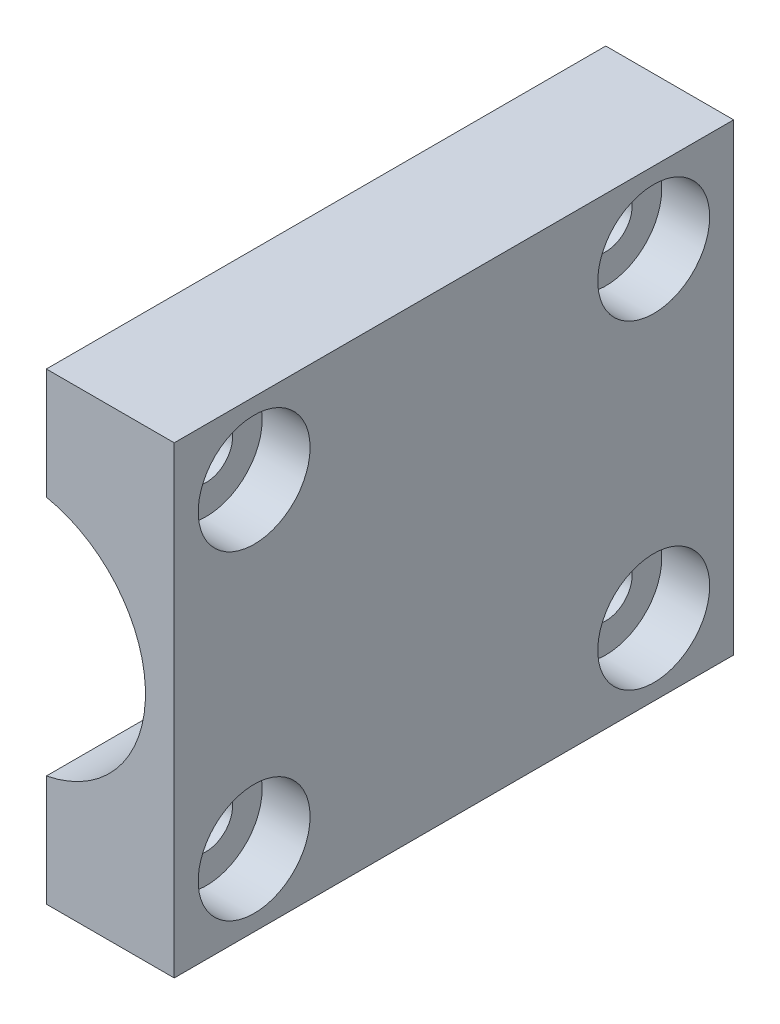
ISO-10303-21;
HEADER;
FILE_DESCRIPTION(('STEP AP214'),'2;1');
FILE_NAME('part.step','',(''),(''),'','','');
FILE_SCHEMA(('AUTOMOTIVE_DESIGN { 1 0 10303 214 1 1 1 1 }'));
ENDSEC;
DATA;
#1=APPLICATION_CONTEXT('core data for automotive mechanical design processes');
#2=APPLICATION_PROTOCOL_DEFINITION('international standard','automotive_design',2000,#1);
#3=PRODUCT_CONTEXT('',#1,'mechanical');
#4=PRODUCT('Part','Part','',(#3));
#5=PRODUCT_RELATED_PRODUCT_CATEGORY('part','',(#4));
#6=PRODUCT_DEFINITION_FORMATION('','',#4);
#7=PRODUCT_DEFINITION_CONTEXT('part definition',#1,'design');
#8=PRODUCT_DEFINITION('design','',#6,#7);
#9=PRODUCT_DEFINITION_SHAPE('','',#8);
#10=(LENGTH_UNIT() NAMED_UNIT(*) SI_UNIT(.MILLI.,.METRE.));
#11=(NAMED_UNIT(*) PLANE_ANGLE_UNIT() SI_UNIT($,.RADIAN.));
#12=(NAMED_UNIT(*) SI_UNIT($,.STERADIAN.) SOLID_ANGLE_UNIT());
#13=UNCERTAINTY_MEASURE_WITH_UNIT(LENGTH_MEASURE(1.E-05),#10,'distance_accuracy_value','');
#14=(GEOMETRIC_REPRESENTATION_CONTEXT(3) GLOBAL_UNCERTAINTY_ASSIGNED_CONTEXT((#13)) GLOBAL_UNIT_ASSIGNED_CONTEXT((#10,
#11,#12)) REPRESENTATION_CONTEXT('',''));
#15=CARTESIAN_POINT('',(0.,0.,0.));
#16=DIRECTION('',(0.,0.,1.));
#17=DIRECTION('',(1.,0.,0.));
#18=AXIS2_PLACEMENT_3D('',#15,#16,#17);
#19=CARTESIAN_POINT('',(9.5,10.,5.));
#20=DIRECTION('',(-1.,0.,0.));
#21=DIRECTION('',(0.,0.,1.));
#22=AXIS2_PLACEMENT_3D('',#19,#20,#21);
#23=CYLINDRICAL_SURFACE('',#22,1.65);
#24=CARTESIAN_POINT('',(1.5,10.,5.));
#25=DIRECTION('',(1.,0.,0.));
#26=DIRECTION('',(0.,0.,-1.));
#27=AXIS2_PLACEMENT_3D('',#24,#25,#26);
#28=CIRCLE('',#27,1.65);
#29=CARTESIAN_POINT('',(1.5,10.,3.35));
#30=VERTEX_POINT('',#29);
#31=EDGE_CURVE('E124',#30,#30,#28,.F.);
#32=ORIENTED_EDGE('',*,*,#31,.T.);
#33=EDGE_LOOP('',(#32));
#34=FACE_BOUND('',#33,.T.);
#35=CARTESIAN_POINT('',(6.5,10.,5.));
#36=DIRECTION('',(1.,0.,0.));
#37=DIRECTION('',(0.,0.,-1.));
#38=AXIS2_PLACEMENT_3D('',#35,#36,#37);
#39=CIRCLE('',#38,1.65);
#40=CARTESIAN_POINT('',(6.5,10.,3.35));
#41=VERTEX_POINT('',#40);
#42=EDGE_CURVE('E36',#41,#41,#39,.F.);
#43=ORIENTED_EDGE('',*,*,#42,.F.);
#44=EDGE_LOOP('',(#43));
#45=FACE_BOUND('',#44,.T.);
#46=ADVANCED_FACE('F32',(#34,#45),#23,.F.);
#47=CARTESIAN_POINT('',(9.5,-10.,30.));
#48=DIRECTION('',(-1.,0.,0.));
#49=DIRECTION('',(0.,0.,1.));
#50=AXIS2_PLACEMENT_3D('',#47,#48,#49);
#51=CYLINDRICAL_SURFACE('',#50,1.65);
#52=CARTESIAN_POINT('',(1.5,-10.,30.));
#53=DIRECTION('',(1.,0.,0.));
#54=DIRECTION('',(0.,0.,-1.));
#55=AXIS2_PLACEMENT_3D('',#52,#53,#54);
#56=CIRCLE('',#55,1.65);
#57=CARTESIAN_POINT('',(1.5,-10.,28.35));
#58=VERTEX_POINT('',#57);
#59=EDGE_CURVE('E121',#58,#58,#56,.F.);
#60=ORIENTED_EDGE('',*,*,#59,.T.);
#61=EDGE_LOOP('',(#60));
#62=FACE_BOUND('',#61,.T.);
#63=CARTESIAN_POINT('',(6.5,-10.,30.));
#64=DIRECTION('',(1.,0.,0.));
#65=DIRECTION('',(0.,0.,-1.));
#66=AXIS2_PLACEMENT_3D('',#63,#64,#65);
#67=CIRCLE('',#66,1.65);
#68=CARTESIAN_POINT('',(6.5,-10.,28.35));
#69=VERTEX_POINT('',#68);
#70=EDGE_CURVE('E148',#69,#69,#67,.F.);
#71=ORIENTED_EDGE('',*,*,#70,.F.);
#72=EDGE_LOOP('',(#71));
#73=FACE_BOUND('',#72,.T.);
#74=ADVANCED_FACE('F192',(#62,#73),#51,.F.);
#75=CARTESIAN_POINT('',(9.5,-10.,5.));
#76=DIRECTION('',(-1.,0.,0.));
#77=DIRECTION('',(0.,0.,1.));
#78=AXIS2_PLACEMENT_3D('',#75,#76,#77);
#79=CYLINDRICAL_SURFACE('',#78,1.65);
#80=CARTESIAN_POINT('',(1.5,-10.,5.));
#81=DIRECTION('',(1.,0.,0.));
#82=DIRECTION('',(0.,0.,-1.));
#83=AXIS2_PLACEMENT_3D('',#80,#81,#82);
#84=CIRCLE('',#83,1.65);
#85=CARTESIAN_POINT('',(1.5,-10.,3.35));
#86=VERTEX_POINT('',#85);
#87=EDGE_CURVE('E118',#86,#86,#84,.F.);
#88=ORIENTED_EDGE('',*,*,#87,.T.);
#89=EDGE_LOOP('',(#88));
#90=FACE_BOUND('',#89,.T.);
#91=CARTESIAN_POINT('',(6.5,-10.,5.));
#92=DIRECTION('',(1.,0.,0.));
#93=DIRECTION('',(0.,0.,-1.));
#94=AXIS2_PLACEMENT_3D('',#91,#92,#93);
#95=CIRCLE('',#94,1.65);
#96=CARTESIAN_POINT('',(6.5,-10.,3.35));
#97=VERTEX_POINT('',#96);
#98=EDGE_CURVE('E146',#97,#97,#95,.F.);
#99=ORIENTED_EDGE('',*,*,#98,.F.);
#100=EDGE_LOOP('',(#99));
#101=FACE_BOUND('',#100,.T.);
#102=ADVANCED_FACE('F198',(#90,#101),#79,.F.);
#103=CARTESIAN_POINT('',(9.5,10.,30.));
#104=DIRECTION('',(-1.,0.,0.));
#105=DIRECTION('',(0.,0.,1.));
#106=AXIS2_PLACEMENT_3D('',#103,#104,#105);
#107=CYLINDRICAL_SURFACE('',#106,1.65);
#108=CARTESIAN_POINT('',(1.5,10.,30.));
#109=DIRECTION('',(1.,0.,0.));
#110=DIRECTION('',(0.,0.,-1.));
#111=AXIS2_PLACEMENT_3D('',#108,#109,#110);
#112=CIRCLE('',#111,1.65);
#113=CARTESIAN_POINT('',(1.5,10.,28.35));
#114=VERTEX_POINT('',#113);
#115=EDGE_CURVE('E127',#114,#114,#112,.F.);
#116=ORIENTED_EDGE('',*,*,#115,.T.);
#117=EDGE_LOOP('',(#116));
#118=FACE_BOUND('',#117,.T.);
#119=CARTESIAN_POINT('',(6.5,10.,30.));
#120=DIRECTION('',(1.,0.,0.));
#121=DIRECTION('',(0.,0.,-1.));
#122=AXIS2_PLACEMENT_3D('',#119,#120,#121);
#123=CIRCLE('',#122,1.65);
#124=CARTESIAN_POINT('',(6.5,10.,28.35));
#125=VERTEX_POINT('',#124);
#126=EDGE_CURVE('E101',#125,#125,#123,.F.);
#127=ORIENTED_EDGE('',*,*,#126,.F.);
#128=EDGE_LOOP('',(#127));
#129=FACE_BOUND('',#128,.T.);
#130=ADVANCED_FACE('F203',(#118,#129),#107,.F.);
#131=CARTESIAN_POINT('',(0.,0.,35.));
#132=DIRECTION('',(0.,0.,-1.));
#133=DIRECTION('',(-1.,0.,0.));
#134=AXIS2_PLACEMENT_3D('',#131,#132,#133);
#135=PLANE('',#134);
#136=DIRECTION('',(0.,-1.,0.));
#137=VECTOR('',#136,1.);
#138=CARTESIAN_POINT('',(1.5,32.5,35.));
#139=LINE('',#138,#137);
#140=CARTESIAN_POINT('',(1.5,-7.55248303539968,35.));
#141=VERTEX_POINT('',#140);
#142=CARTESIAN_POINT('',(1.5,-14.5,35.));
#143=VERTEX_POINT('',#142);
#144=EDGE_CURVE('E100',#141,#143,#139,.T.);
#145=ORIENTED_EDGE('',*,*,#144,.T.);
#146=DIRECTION('',(1.,0.,0.));
#147=VECTOR('',#146,1.);
#148=CARTESIAN_POINT('',(1.49999999999999,-14.5,35.));
#149=LINE('',#148,#147);
#150=CARTESIAN_POINT('',(9.5,-14.5,35.));
#151=VERTEX_POINT('',#150);
#152=EDGE_CURVE('E49',#143,#151,#149,.T.);
#153=ORIENTED_EDGE('',*,*,#152,.T.);
#154=DIRECTION('',(0.,1.,0.));
#155=VECTOR('',#154,1.);
#156=CARTESIAN_POINT('',(9.5,-32.5,35.));
#157=LINE('',#156,#155);
#158=CARTESIAN_POINT('',(9.50000000000001,14.5,35.));
#159=VERTEX_POINT('',#158);
#160=EDGE_CURVE('E11',#151,#159,#157,.T.);
#161=ORIENTED_EDGE('',*,*,#160,.T.);
#162=DIRECTION('',(-1.,0.,0.));
#163=VECTOR('',#162,1.);
#164=CARTESIAN_POINT('',(1.5,14.5,35.));
#165=LINE('',#164,#163);
#166=CARTESIAN_POINT('',(1.5,14.5,35.));
#167=VERTEX_POINT('',#166);
#168=EDGE_CURVE('E106',#159,#167,#165,.T.);
#169=ORIENTED_EDGE('',*,*,#168,.T.);
#170=CARTESIAN_POINT('',(1.5,7.55248303539968,35.));
#171=VERTEX_POINT('',#170);
#172=EDGE_CURVE('E112',#167,#171,#139,.T.);
#173=ORIENTED_EDGE('',*,*,#172,.T.);
#174=CARTESIAN_POINT('',(0.,0.,35.));
#175=DIRECTION('',(0.,0.,1.));
#176=DIRECTION('',(1.,0.,0.));
#177=AXIS2_PLACEMENT_3D('',#174,#175,#176);
#178=CIRCLE('',#177,7.7);
#179=EDGE_CURVE('E137',#141,#171,#178,.T.);
#180=ORIENTED_EDGE('',*,*,#179,.F.);
#181=EDGE_LOOP('',(#145,#153,#161,#169,#173,#180));
#182=FACE_BOUND('',#181,.T.);
#183=ADVANCED_FACE('F96',(#182),#135,.F.);
#184=CARTESIAN_POINT('',(0.,0.,0.));
#185=DIRECTION('',(0.,0.,-1.));
#186=DIRECTION('',(-1.,0.,0.));
#187=AXIS2_PLACEMENT_3D('',#184,#185,#186);
#188=PLANE('',#187);
#189=DIRECTION('',(1.,0.,0.));
#190=VECTOR('',#189,1.);
#191=CARTESIAN_POINT('',(0.,-14.5,0.));
#192=LINE('',#191,#190);
#193=CARTESIAN_POINT('',(1.49999999999999,-14.5,0.));
#194=VERTEX_POINT('',#193);
#195=CARTESIAN_POINT('',(9.5,-14.5,0.));
#196=VERTEX_POINT('',#195);
#197=EDGE_CURVE('E88',#194,#196,#192,.T.);
#198=ORIENTED_EDGE('',*,*,#197,.F.);
#199=DIRECTION('',(0.,1.,0.));
#200=VECTOR('',#199,1.);
#201=CARTESIAN_POINT('',(1.5,32.5,0.));
#202=LINE('',#201,#200);
#203=CARTESIAN_POINT('',(1.5,-7.55248303539968,0.));
#204=VERTEX_POINT('',#203);
#205=EDGE_CURVE('E117',#194,#204,#202,.T.);
#206=ORIENTED_EDGE('',*,*,#205,.T.);
#207=CARTESIAN_POINT('',(0.,0.,0.));
#208=DIRECTION('',(0.,0.,1.));
#209=DIRECTION('',(1.,0.,0.));
#210=AXIS2_PLACEMENT_3D('',#207,#208,#209);
#211=CIRCLE('',#210,7.7);
#212=CARTESIAN_POINT('',(1.5,7.55248303539968,0.));
#213=VERTEX_POINT('',#212);
#214=EDGE_CURVE('E136',#204,#213,#211,.T.);
#215=ORIENTED_EDGE('',*,*,#214,.T.);
#216=CARTESIAN_POINT('',(1.5,14.5,0.));
#217=VERTEX_POINT('',#216);
#218=EDGE_CURVE('E114',#213,#217,#202,.T.);
#219=ORIENTED_EDGE('',*,*,#218,.T.);
#220=DIRECTION('',(-1.,0.,0.));
#221=VECTOR('',#220,1.);
#222=CARTESIAN_POINT('',(0.,14.5,0.));
#223=LINE('',#222,#221);
#224=CARTESIAN_POINT('',(9.50000000000001,14.5,0.));
#225=VERTEX_POINT('',#224);
#226=EDGE_CURVE('E57',#225,#217,#223,.T.);
#227=ORIENTED_EDGE('',*,*,#226,.F.);
#228=DIRECTION('',(0.,1.,0.));
#229=VECTOR('',#228,1.);
#230=CARTESIAN_POINT('',(9.5,-32.5,0.));
#231=LINE('',#230,#229);
#232=EDGE_CURVE('E41',#196,#225,#231,.T.);
#233=ORIENTED_EDGE('',*,*,#232,.F.);
#234=EDGE_LOOP('',(#198,#206,#215,#219,#227,#233));
#235=FACE_BOUND('',#234,.T.);
#236=ADVANCED_FACE('F169',(#235),#188,.T.);
#237=CARTESIAN_POINT('',(9.5,-32.5,35.));
#238=DIRECTION('',(-1.,0.,0.));
#239=DIRECTION('',(0.,0.,1.));
#240=AXIS2_PLACEMENT_3D('',#237,#238,#239);
#241=PLANE('',#240);
#242=CARTESIAN_POINT('',(9.5,10.,5.));
#243=DIRECTION('',(1.,0.,0.));
#244=DIRECTION('',(0.,0.,-1.));
#245=AXIS2_PLACEMENT_3D('',#242,#243,#244);
#246=CIRCLE('',#245,3.5);
#247=CARTESIAN_POINT('',(9.5,10.,1.5));
#248=VERTEX_POINT('',#247);
#249=EDGE_CURVE('E223',#248,#248,#246,.T.);
#250=ORIENTED_EDGE('',*,*,#249,.F.);
#251=EDGE_LOOP('',(#250));
#252=FACE_BOUND('',#251,.T.);
#253=CARTESIAN_POINT('',(9.5,-10.,5.));
#254=DIRECTION('',(1.,0.,0.));
#255=DIRECTION('',(0.,0.,-1.));
#256=AXIS2_PLACEMENT_3D('',#253,#254,#255);
#257=CIRCLE('',#256,3.5);
#258=CARTESIAN_POINT('',(9.5,-10.,1.5));
#259=VERTEX_POINT('',#258);
#260=EDGE_CURVE('E227',#259,#259,#257,.T.);
#261=ORIENTED_EDGE('',*,*,#260,.F.);
#262=EDGE_LOOP('',(#261));
#263=FACE_BOUND('',#262,.T.);
#264=CARTESIAN_POINT('',(9.5,-10.,30.));
#265=DIRECTION('',(1.,0.,0.));
#266=DIRECTION('',(0.,0.,-1.));
#267=AXIS2_PLACEMENT_3D('',#264,#265,#266);
#268=CIRCLE('',#267,3.5);
#269=CARTESIAN_POINT('',(9.5,-10.,26.5));
#270=VERTEX_POINT('',#269);
#271=EDGE_CURVE('E231',#270,#270,#268,.T.);
#272=ORIENTED_EDGE('',*,*,#271,.F.);
#273=EDGE_LOOP('',(#272));
#274=FACE_BOUND('',#273,.T.);
#275=CARTESIAN_POINT('',(9.5,10.,30.));
#276=DIRECTION('',(1.,0.,0.));
#277=DIRECTION('',(0.,0.,-1.));
#278=AXIS2_PLACEMENT_3D('',#275,#276,#277);
#279=CIRCLE('',#278,3.5);
#280=CARTESIAN_POINT('',(9.5,10.,26.5));
#281=VERTEX_POINT('',#280);
#282=EDGE_CURVE('E154',#281,#281,#279,.T.);
#283=ORIENTED_EDGE('',*,*,#282,.F.);
#284=EDGE_LOOP('',(#283));
#285=FACE_BOUND('',#284,.T.);
#286=ORIENTED_EDGE('',*,*,#160,.F.);
#287=DIRECTION('',(0.,0.,-1.));
#288=VECTOR('',#287,1.);
#289=CARTESIAN_POINT('',(9.5,-14.5,35.));
#290=LINE('',#289,#288);
#291=EDGE_CURVE('E85',#151,#196,#290,.T.);
#292=ORIENTED_EDGE('',*,*,#291,.T.);
#293=ORIENTED_EDGE('',*,*,#232,.T.);
#294=DIRECTION('',(0.,0.,-1.));
#295=VECTOR('',#294,1.);
#296=CARTESIAN_POINT('',(9.50000000000001,14.5,35.));
#297=LINE('',#296,#295);
#298=EDGE_CURVE('E104',#159,#225,#297,.T.);
#299=ORIENTED_EDGE('',*,*,#298,.F.);
#300=EDGE_LOOP('',(#286,#292,#293,#299));
#301=FACE_BOUND('',#300,.T.);
#302=ADVANCED_FACE('F34',(#252,#263,#274,#285,#301),#241,.F.);
#303=CARTESIAN_POINT('',(0.,0.,35.));
#304=DIRECTION('',(0.,0.,-1.));
#305=DIRECTION('',(-1.,0.,0.));
#306=AXIS2_PLACEMENT_3D('',#303,#304,#305);
#307=CYLINDRICAL_SURFACE('',#306,7.7);
#308=DIRECTION('',(0.,0.,-1.));
#309=VECTOR('',#308,1.);
#310=CARTESIAN_POINT('',(1.5,-7.55248303539968,35.));
#311=LINE('',#310,#309);
#312=EDGE_CURVE('E133',#141,#204,#311,.T.);
#313=ORIENTED_EDGE('',*,*,#312,.F.);
#314=ORIENTED_EDGE('',*,*,#179,.T.);
#315=DIRECTION('',(0.,0.,-1.));
#316=VECTOR('',#315,1.);
#317=CARTESIAN_POINT('',(1.5,7.55248303539968,35.));
#318=LINE('',#317,#316);
#319=EDGE_CURVE('E130',#213,#171,#318,.F.);
#320=ORIENTED_EDGE('',*,*,#319,.F.);
#321=ORIENTED_EDGE('',*,*,#214,.F.);
#322=EDGE_LOOP('',(#313,#314,#320,#321));
#323=FACE_BOUND('',#322,.T.);
#324=ADVANCED_FACE('F176',(#323),#307,.F.);
#325=CARTESIAN_POINT('',(1.5,0.,0.));
#326=DIRECTION('',(1.,0.,0.));
#327=DIRECTION('',(0.,0.,-1.));
#328=AXIS2_PLACEMENT_3D('',#325,#326,#327);
#329=PLANE('',#328);
#330=ORIENTED_EDGE('',*,*,#172,.F.);
#331=DIRECTION('',(0.,0.,-1.));
#332=VECTOR('',#331,1.);
#333=CARTESIAN_POINT('',(1.5,14.5,35.));
#334=LINE('',#333,#332);
#335=EDGE_CURVE('E105',#167,#217,#334,.T.);
#336=ORIENTED_EDGE('',*,*,#335,.T.);
#337=ORIENTED_EDGE('',*,*,#218,.F.);
#338=ORIENTED_EDGE('',*,*,#319,.T.);
#339=EDGE_LOOP('',(#330,#336,#337,#338));
#340=FACE_BOUND('',#339,.T.);
#341=ORIENTED_EDGE('',*,*,#31,.F.);
#342=EDGE_LOOP('',(#341));
#343=FACE_BOUND('',#342,.T.);
#344=ORIENTED_EDGE('',*,*,#115,.F.);
#345=EDGE_LOOP('',(#344));
#346=FACE_BOUND('',#345,.T.);
#347=ADVANCED_FACE('F179',(#340,#343,#346),#329,.F.);
#348=ORIENTED_EDGE('',*,*,#205,.F.);
#349=DIRECTION('',(0.,0.,-1.));
#350=VECTOR('',#349,1.);
#351=CARTESIAN_POINT('',(1.49999999999999,-14.5,35.));
#352=LINE('',#351,#350);
#353=EDGE_CURVE('E92',#143,#194,#352,.T.);
#354=ORIENTED_EDGE('',*,*,#353,.F.);
#355=ORIENTED_EDGE('',*,*,#144,.F.);
#356=ORIENTED_EDGE('',*,*,#312,.T.);
#357=EDGE_LOOP('',(#348,#354,#355,#356));
#358=FACE_BOUND('',#357,.T.);
#359=ORIENTED_EDGE('',*,*,#87,.F.);
#360=EDGE_LOOP('',(#359));
#361=FACE_BOUND('',#360,.T.);
#362=ORIENTED_EDGE('',*,*,#59,.F.);
#363=EDGE_LOOP('',(#362));
#364=FACE_BOUND('',#363,.T.);
#365=ADVANCED_FACE('F170',(#358,#361,#364),#329,.F.);
#366=CARTESIAN_POINT('',(1.5,14.5,35.));
#367=DIRECTION('',(0.,-1.,0.));
#368=DIRECTION('',(1.,0.,0.));
#369=AXIS2_PLACEMENT_3D('',#366,#367,#368);
#370=PLANE('',#369);
#371=ORIENTED_EDGE('',*,*,#226,.T.);
#372=ORIENTED_EDGE('',*,*,#335,.F.);
#373=ORIENTED_EDGE('',*,*,#168,.F.);
#374=ORIENTED_EDGE('',*,*,#298,.T.);
#375=EDGE_LOOP('',(#371,#372,#373,#374));
#376=FACE_BOUND('',#375,.T.);
#377=ADVANCED_FACE('F181',(#376),#370,.F.);
#378=CARTESIAN_POINT('',(1.49999999999999,-14.5,35.));
#379=DIRECTION('',(0.,1.,0.));
#380=DIRECTION('',(-1.,0.,0.));
#381=AXIS2_PLACEMENT_3D('',#378,#379,#380);
#382=PLANE('',#381);
#383=ORIENTED_EDGE('',*,*,#197,.T.);
#384=ORIENTED_EDGE('',*,*,#291,.F.);
#385=ORIENTED_EDGE('',*,*,#152,.F.);
#386=ORIENTED_EDGE('',*,*,#353,.T.);
#387=EDGE_LOOP('',(#383,#384,#385,#386));
#388=FACE_BOUND('',#387,.T.);
#389=ADVANCED_FACE('F86',(#388),#382,.F.);
#390=CARTESIAN_POINT('',(6.5,10.,30.));
#391=DIRECTION('',(1.,0.,0.));
#392=DIRECTION('',(0.,0.,-1.));
#393=AXIS2_PLACEMENT_3D('',#390,#391,#392);
#394=PLANE('',#393);
#395=CARTESIAN_POINT('',(6.5,10.,30.));
#396=DIRECTION('',(1.,0.,0.));
#397=DIRECTION('',(0.,0.,-1.));
#398=AXIS2_PLACEMENT_3D('',#395,#396,#397);
#399=CIRCLE('',#398,3.5);
#400=CARTESIAN_POINT('',(6.5,10.,26.5));
#401=VERTEX_POINT('',#400);
#402=EDGE_CURVE('E145',#401,#401,#399,.T.);
#403=ORIENTED_EDGE('',*,*,#402,.T.);
#404=EDGE_LOOP('',(#403));
#405=FACE_BOUND('',#404,.T.);
#406=ORIENTED_EDGE('',*,*,#126,.T.);
#407=EDGE_LOOP('',(#406));
#408=FACE_BOUND('',#407,.T.);
#409=ADVANCED_FACE('F188',(#405,#408),#394,.T.);
#410=CARTESIAN_POINT('',(6.5,10.,30.));
#411=DIRECTION('',(1.,0.,0.));
#412=DIRECTION('',(0.,0.,-1.));
#413=AXIS2_PLACEMENT_3D('',#410,#411,#412);
#414=CYLINDRICAL_SURFACE('',#413,3.5);
#415=ORIENTED_EDGE('',*,*,#402,.F.);
#416=EDGE_LOOP('',(#415));
#417=FACE_BOUND('',#416,.T.);
#418=ORIENTED_EDGE('',*,*,#282,.T.);
#419=EDGE_LOOP('',(#418));
#420=FACE_BOUND('',#419,.T.);
#421=ADVANCED_FACE('F261',(#417,#420),#414,.F.);
#422=CARTESIAN_POINT('',(6.5,-10.,5.));
#423=DIRECTION('',(1.,0.,0.));
#424=DIRECTION('',(0.,0.,-1.));
#425=AXIS2_PLACEMENT_3D('',#422,#423,#424);
#426=PLANE('',#425);
#427=CARTESIAN_POINT('',(6.5,-10.,5.));
#428=DIRECTION('',(1.,0.,0.));
#429=DIRECTION('',(0.,0.,-1.));
#430=AXIS2_PLACEMENT_3D('',#427,#428,#429);
#431=CIRCLE('',#430,3.5);
#432=CARTESIAN_POINT('',(6.5,-10.,1.5));
#433=VERTEX_POINT('',#432);
#434=EDGE_CURVE('E238',#433,#433,#431,.T.);
#435=ORIENTED_EDGE('',*,*,#434,.T.);
#436=EDGE_LOOP('',(#435));
#437=FACE_BOUND('',#436,.T.);
#438=ORIENTED_EDGE('',*,*,#98,.T.);
#439=EDGE_LOOP('',(#438));
#440=FACE_BOUND('',#439,.T.);
#441=ADVANCED_FACE('F257',(#437,#440),#426,.T.);
#442=CARTESIAN_POINT('',(6.5,-10.,5.));
#443=DIRECTION('',(1.,0.,0.));
#444=DIRECTION('',(0.,0.,-1.));
#445=AXIS2_PLACEMENT_3D('',#442,#443,#444);
#446=CYLINDRICAL_SURFACE('',#445,3.5);
#447=ORIENTED_EDGE('',*,*,#434,.F.);
#448=EDGE_LOOP('',(#447));
#449=FACE_BOUND('',#448,.T.);
#450=ORIENTED_EDGE('',*,*,#260,.T.);
#451=EDGE_LOOP('',(#450));
#452=FACE_BOUND('',#451,.T.);
#453=ADVANCED_FACE('F260',(#449,#452),#446,.F.);
#454=CARTESIAN_POINT('',(6.5,-10.,30.));
#455=DIRECTION('',(1.,0.,0.));
#456=DIRECTION('',(0.,0.,-1.));
#457=AXIS2_PLACEMENT_3D('',#454,#455,#456);
#458=PLANE('',#457);
#459=CARTESIAN_POINT('',(6.5,-10.,30.));
#460=DIRECTION('',(1.,0.,0.));
#461=DIRECTION('',(0.,0.,-1.));
#462=AXIS2_PLACEMENT_3D('',#459,#460,#461);
#463=CIRCLE('',#462,3.5);
#464=CARTESIAN_POINT('',(6.5,-10.,26.5));
#465=VERTEX_POINT('',#464);
#466=EDGE_CURVE('E233',#465,#465,#463,.T.);
#467=ORIENTED_EDGE('',*,*,#466,.T.);
#468=EDGE_LOOP('',(#467));
#469=FACE_BOUND('',#468,.T.);
#470=ORIENTED_EDGE('',*,*,#70,.T.);
#471=EDGE_LOOP('',(#470));
#472=FACE_BOUND('',#471,.T.);
#473=ADVANCED_FACE('F265',(#469,#472),#458,.T.);
#474=CARTESIAN_POINT('',(6.5,-10.,30.));
#475=DIRECTION('',(1.,0.,0.));
#476=DIRECTION('',(0.,0.,-1.));
#477=AXIS2_PLACEMENT_3D('',#474,#475,#476);
#478=CYLINDRICAL_SURFACE('',#477,3.5);
#479=ORIENTED_EDGE('',*,*,#466,.F.);
#480=EDGE_LOOP('',(#479));
#481=FACE_BOUND('',#480,.T.);
#482=ORIENTED_EDGE('',*,*,#271,.T.);
#483=EDGE_LOOP('',(#482));
#484=FACE_BOUND('',#483,.T.);
#485=ADVANCED_FACE('F254',(#481,#484),#478,.F.);
#486=CARTESIAN_POINT('',(6.5,10.,5.));
#487=DIRECTION('',(1.,0.,0.));
#488=DIRECTION('',(0.,0.,-1.));
#489=AXIS2_PLACEMENT_3D('',#486,#487,#488);
#490=PLANE('',#489);
#491=CARTESIAN_POINT('',(6.5,10.,5.));
#492=DIRECTION('',(1.,0.,0.));
#493=DIRECTION('',(0.,0.,-1.));
#494=AXIS2_PLACEMENT_3D('',#491,#492,#493);
#495=CIRCLE('',#494,3.5);
#496=CARTESIAN_POINT('',(6.5,10.,1.5));
#497=VERTEX_POINT('',#496);
#498=EDGE_CURVE('E149',#497,#497,#495,.T.);
#499=ORIENTED_EDGE('',*,*,#498,.T.);
#500=EDGE_LOOP('',(#499));
#501=FACE_BOUND('',#500,.T.);
#502=ORIENTED_EDGE('',*,*,#42,.T.);
#503=EDGE_LOOP('',(#502));
#504=FACE_BOUND('',#503,.T.);
#505=ADVANCED_FACE('F245',(#501,#504),#490,.T.);
#506=CARTESIAN_POINT('',(6.5,10.,5.));
#507=DIRECTION('',(1.,0.,0.));
#508=DIRECTION('',(0.,0.,-1.));
#509=AXIS2_PLACEMENT_3D('',#506,#507,#508);
#510=CYLINDRICAL_SURFACE('',#509,3.5);
#511=ORIENTED_EDGE('',*,*,#498,.F.);
#512=EDGE_LOOP('',(#511));
#513=FACE_BOUND('',#512,.T.);
#514=ORIENTED_EDGE('',*,*,#249,.T.);
#515=EDGE_LOOP('',(#514));
#516=FACE_BOUND('',#515,.T.);
#517=ADVANCED_FACE('F247',(#513,#516),#510,.F.);
#518=CLOSED_SHELL('',(#46,#74,#102,#130,#183,#236,#302,#324,#347,#365,#377,#389,#409,#421,#441,
#453,#473,#485,#505,#517));
#519=MANIFOLD_SOLID_BREP('B2',#518);
#520=ADVANCED_BREP_SHAPE_REPRESENTATION('',(#18,#519),#14);
#521=SHAPE_DEFINITION_REPRESENTATION(#9,#520);
ENDSEC;
END-ISO-10303-21;
